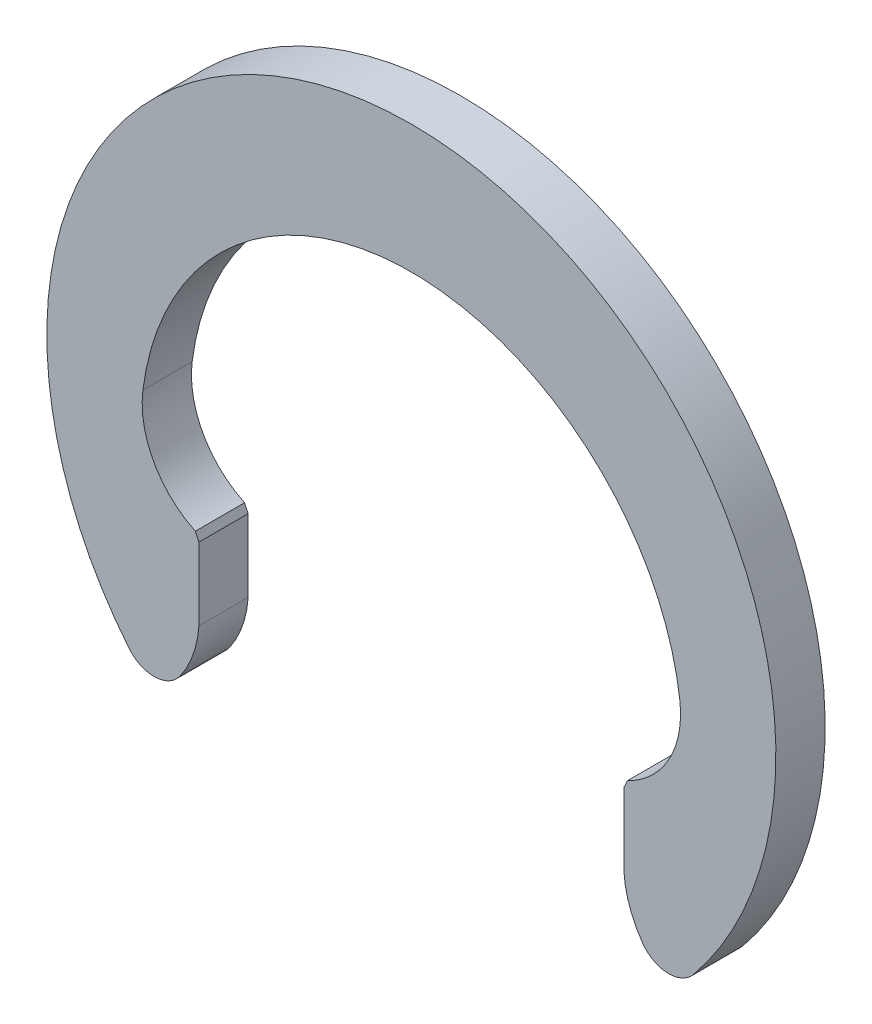
ISO-10303-21;
HEADER;
FILE_DESCRIPTION(('STEP AP214'),'2;1');
FILE_NAME('part.step','',(''),(''),'','','');
FILE_SCHEMA(('AUTOMOTIVE_DESIGN { 1 0 10303 214 1 1 1 1 }'));
ENDSEC;
DATA;
#1=APPLICATION_CONTEXT('core data for automotive mechanical design processes');
#2=APPLICATION_PROTOCOL_DEFINITION('international standard','automotive_design',2000,#1);
#3=PRODUCT_CONTEXT('',#1,'mechanical');
#4=PRODUCT('Part','Part','',(#3));
#5=PRODUCT_RELATED_PRODUCT_CATEGORY('part','',(#4));
#6=PRODUCT_DEFINITION_FORMATION('','',#4);
#7=PRODUCT_DEFINITION_CONTEXT('part definition',#1,'design');
#8=PRODUCT_DEFINITION('design','',#6,#7);
#9=PRODUCT_DEFINITION_SHAPE('','',#8);
#10=(LENGTH_UNIT() NAMED_UNIT(*) SI_UNIT(.MILLI.,.METRE.));
#11=(NAMED_UNIT(*) PLANE_ANGLE_UNIT() SI_UNIT($,.RADIAN.));
#12=(NAMED_UNIT(*) SI_UNIT($,.STERADIAN.) SOLID_ANGLE_UNIT());
#13=UNCERTAINTY_MEASURE_WITH_UNIT(LENGTH_MEASURE(1.E-05),#10,'distance_accuracy_value','');
#14=(GEOMETRIC_REPRESENTATION_CONTEXT(3) GLOBAL_UNCERTAINTY_ASSIGNED_CONTEXT((#13)) GLOBAL_UNIT_ASSIGNED_CONTEXT((#10,
#11,#12)) REPRESENTATION_CONTEXT('',''));
#15=CARTESIAN_POINT('',(0.,0.,0.));
#16=DIRECTION('',(0.,0.,1.));
#17=DIRECTION('',(1.,0.,0.));
#18=AXIS2_PLACEMENT_3D('',#15,#16,#17);
#19=CARTESIAN_POINT('',(0.,0.,-0.35));
#20=DIRECTION('',(0.,0.,1.));
#21=DIRECTION('',(1.,0.,0.));
#22=AXIS2_PLACEMENT_3D('',#19,#20,#21);
#23=PLANE('',#22);
#24=CARTESIAN_POINT('',(0.,0.,-0.35));
#25=DIRECTION('',(0.,0.,1.));
#26=DIRECTION('',(1.,0.,0.));
#27=AXIS2_PLACEMENT_3D('',#24,#25,#26);
#28=CIRCLE('',#27,3.7);
#29=CARTESIAN_POINT('',(2.86362795950369,-2.34299699307292,-0.35));
#30=VERTEX_POINT('',#29);
#31=CARTESIAN_POINT('',(-2.86362795950368,-2.34299699307293,-0.35));
#32=VERTEX_POINT('',#31);
#33=EDGE_CURVE('E189',#30,#32,#28,.T.);
#34=ORIENTED_EDGE('',*,*,#33,.F.);
#35=CARTESIAN_POINT('',(2.6120930711689,-2.13719320314084,-0.35));
#36=DIRECTION('',(0.,0.,-1.));
#37=DIRECTION('',(1.,0.,0.));
#38=AXIS2_PLACEMENT_3D('',#35,#36,#37);
#39=CIRCLE('',#38,0.325);
#40=CARTESIAN_POINT('',(2.34627823993633,-2.32418912688464,-0.35));
#41=VERTEX_POINT('',#40);
#42=EDGE_CURVE('E137',#30,#41,#39,.T.);
#43=ORIENTED_EDGE('',*,*,#42,.T.);
#44=CARTESIAN_POINT('',(3.20865351956933,-1.71752372269696,-0.35));
#45=DIRECTION('',(0.,0.,1.));
#46=DIRECTION('',(1.,0.,0.));
#47=AXIS2_PLACEMENT_3D('',#44,#45,#46);
#48=CIRCLE('',#47,1.05438799099777);
#49=CARTESIAN_POINT('',(2.15667568261897,-1.78877444989019,-0.35));
#50=VERTEX_POINT('',#49);
#51=EDGE_CURVE('E145',#50,#41,#48,.T.);
#52=ORIENTED_EDGE('',*,*,#51,.F.);
#53=DIRECTION('',(0.,-1.,0.));
#54=VECTOR('',#53,1.);
#55=CARTESIAN_POINT('',(2.15667568261898,-1.78877444989019,-0.35));
#56=LINE('',#55,#54);
#57=CARTESIAN_POINT('',(2.15667568261897,-1.05297198443263,-0.35));
#58=VERTEX_POINT('',#57);
#59=EDGE_CURVE('E11',#58,#50,#56,.T.);
#60=ORIENTED_EDGE('',*,*,#59,.F.);
#61=CARTESIAN_POINT('',(0.,0.,-0.35));
#62=DIRECTION('',(0.,0.,-1.));
#63=DIRECTION('',(-1.,0.,0.));
#64=AXIS2_PLACEMENT_3D('',#61,#62,#63);
#65=CIRCLE('',#64,2.4);
#66=CARTESIAN_POINT('',(2.19302872758202,-0.975,-0.35));
#67=VERTEX_POINT('',#66);
#68=EDGE_CURVE('E175',#67,#58,#65,.T.);
#69=ORIENTED_EDGE('',*,*,#68,.F.);
#70=CARTESIAN_POINT('',(1.78492705087858,-0.119710168645288,-0.35));
#71=DIRECTION('',(0.,0.,-1.));
#72=DIRECTION('',(-1.,0.,0.));
#73=AXIS2_PLACEMENT_3D('',#70,#71,#72);
#74=CIRCLE('',#73,0.947664325669659);
#75=CARTESIAN_POINT('',(2.725,0.,-0.35));
#76=VERTEX_POINT('',#75);
#77=EDGE_CURVE('E176',#76,#67,#74,.T.);
#78=ORIENTED_EDGE('',*,*,#77,.F.);
#79=CARTESIAN_POINT('',(0.,-0.347005208333333,-0.35));
#80=DIRECTION('',(0.,0.,-1.));
#81=DIRECTION('',(1.,0.,0.));
#82=AXIS2_PLACEMENT_3D('',#79,#80,#81);
#83=CIRCLE('',#82,2.74700520833333);
#84=CARTESIAN_POINT('',(-2.725,0.,-0.35));
#85=VERTEX_POINT('',#84);
#86=EDGE_CURVE('E225',#85,#76,#83,.T.);
#87=ORIENTED_EDGE('',*,*,#86,.F.);
#88=CARTESIAN_POINT('',(-1.78492705087858,-0.119710168645288,-0.35));
#89=DIRECTION('',(0.,0.,-1.));
#90=DIRECTION('',(1.,0.,0.));
#91=AXIS2_PLACEMENT_3D('',#88,#89,#90);
#92=CIRCLE('',#91,0.947664325669659);
#93=CARTESIAN_POINT('',(-2.19302872758202,-0.975,-0.35));
#94=VERTEX_POINT('',#93);
#95=EDGE_CURVE('E185',#94,#85,#92,.T.);
#96=ORIENTED_EDGE('',*,*,#95,.F.);
#97=CARTESIAN_POINT('',(0.,0.,-0.35));
#98=DIRECTION('',(0.,0.,-1.));
#99=DIRECTION('',(1.,0.,0.));
#100=AXIS2_PLACEMENT_3D('',#97,#98,#99);
#101=CIRCLE('',#100,2.4);
#102=CARTESIAN_POINT('',(-2.15667568261897,-1.05297198443263,-0.35));
#103=VERTEX_POINT('',#102);
#104=EDGE_CURVE('E90',#103,#94,#101,.T.);
#105=ORIENTED_EDGE('',*,*,#104,.F.);
#106=DIRECTION('',(0.,1.,0.));
#107=VECTOR('',#106,1.);
#108=CARTESIAN_POINT('',(-2.15667568261897,-1.42087321716141,-0.35));
#109=LINE('',#108,#107);
#110=CARTESIAN_POINT('',(-2.15667568261897,-1.78877444989019,-0.35));
#111=VERTEX_POINT('',#110);
#112=EDGE_CURVE('E170',#111,#103,#109,.T.);
#113=ORIENTED_EDGE('',*,*,#112,.F.);
#114=CARTESIAN_POINT('',(-3.20865351956933,-1.71752372269696,-0.35));
#115=DIRECTION('',(0.,0.,1.));
#116=DIRECTION('',(-1.,0.,0.));
#117=AXIS2_PLACEMENT_3D('',#114,#115,#116);
#118=CIRCLE('',#117,1.05438799099777);
#119=CARTESIAN_POINT('',(-2.34627823993633,-2.32418912688465,-0.35));
#120=VERTEX_POINT('',#119);
#121=EDGE_CURVE('E190',#120,#111,#118,.T.);
#122=ORIENTED_EDGE('',*,*,#121,.F.);
#123=CARTESIAN_POINT('',(-2.6120930711689,-2.13719320314084,-0.35));
#124=DIRECTION('',(0.,0.,-1.));
#125=DIRECTION('',(1.,0.,0.));
#126=AXIS2_PLACEMENT_3D('',#123,#124,#125);
#127=CIRCLE('',#126,0.325);
#128=EDGE_CURVE('E77',#120,#32,#127,.T.);
#129=ORIENTED_EDGE('',*,*,#128,.T.);
#130=EDGE_LOOP('',(#34,#43,#52,#60,#69,#78,#87,#96,#105,#113,#122,#129));
#131=FACE_BOUND('',#130,.T.);
#132=ADVANCED_FACE('F16',(#131),#23,.F.);
#133=CARTESIAN_POINT('',(2.15667568261898,-1.78877444989019,0.35));
#134=DIRECTION('',(1.,0.,0.));
#135=DIRECTION('',(0.,1.,0.));
#136=AXIS2_PLACEMENT_3D('',#133,#134,#135);
#137=PLANE('',#136);
#138=DIRECTION('',(0.,1.,0.));
#139=VECTOR('',#138,1.);
#140=CARTESIAN_POINT('',(2.15667568261897,-0.894387224945091,0.15));
#141=LINE('',#140,#139);
#142=CARTESIAN_POINT('',(2.15667568261897,-1.78877444989019,0.15));
#143=VERTEX_POINT('',#142);
#144=CARTESIAN_POINT('',(2.15667568261897,-1.05297198443263,0.15));
#145=VERTEX_POINT('',#144);
#146=EDGE_CURVE('E241',#143,#145,#141,.T.);
#147=ORIENTED_EDGE('',*,*,#146,.T.);
#148=DIRECTION('',(0.,0.,-1.));
#149=VECTOR('',#148,1.);
#150=CARTESIAN_POINT('',(2.15667568261897,-1.05297198443263,0.35));
#151=LINE('',#150,#149);
#152=EDGE_CURVE('E27',#145,#58,#151,.T.);
#153=ORIENTED_EDGE('',*,*,#152,.T.);
#154=ORIENTED_EDGE('',*,*,#59,.T.);
#155=DIRECTION('',(0.,0.,-1.));
#156=VECTOR('',#155,1.);
#157=CARTESIAN_POINT('',(2.15667568261897,-1.78877444989019,0.35));
#158=LINE('',#157,#156);
#159=EDGE_CURVE('E149',#143,#50,#158,.T.);
#160=ORIENTED_EDGE('',*,*,#159,.F.);
#161=EDGE_LOOP('',(#147,#153,#154,#160));
#162=FACE_BOUND('',#161,.T.);
#163=ADVANCED_FACE('F18',(#162),#137,.F.);
#164=CARTESIAN_POINT('',(0.,0.,0.35));
#165=DIRECTION('',(0.,0.,-1.));
#166=DIRECTION('',(-1.,0.,0.));
#167=AXIS2_PLACEMENT_3D('',#164,#165,#166);
#168=CYLINDRICAL_SURFACE('',#167,2.4);
#169=CARTESIAN_POINT('',(0.,0.,0.15));
#170=DIRECTION('',(0.,0.,1.));
#171=DIRECTION('',(-1.,0.,0.));
#172=AXIS2_PLACEMENT_3D('',#169,#170,#171);
#173=CIRCLE('',#172,2.4);
#174=CARTESIAN_POINT('',(2.19302872758202,-0.975,0.15));
#175=VERTEX_POINT('',#174);
#176=EDGE_CURVE('E249',#145,#175,#173,.T.);
#177=ORIENTED_EDGE('',*,*,#176,.T.);
#178=DIRECTION('',(0.,0.,-1.));
#179=VECTOR('',#178,1.);
#180=CARTESIAN_POINT('',(2.19302872758202,-0.975,0.35));
#181=LINE('',#180,#179);
#182=EDGE_CURVE('E171',#175,#67,#181,.T.);
#183=ORIENTED_EDGE('',*,*,#182,.T.);
#184=ORIENTED_EDGE('',*,*,#68,.T.);
#185=ORIENTED_EDGE('',*,*,#152,.F.);
#186=EDGE_LOOP('',(#177,#183,#184,#185));
#187=FACE_BOUND('',#186,.T.);
#188=ADVANCED_FACE('F279',(#187),#168,.F.);
#189=CARTESIAN_POINT('',(1.78492705087858,-0.119710168645288,0.35));
#190=DIRECTION('',(0.,0.,-1.));
#191=DIRECTION('',(0.87783762329979,-0.478958356351965,0.));
#192=AXIS2_PLACEMENT_3D('',#189,#190,#191);
#193=CYLINDRICAL_SURFACE('',#192,0.947664325669659);
#194=CARTESIAN_POINT('',(1.78492705087858,-0.119710168645288,0.15));
#195=DIRECTION('',(0.,0.,1.));
#196=DIRECTION('',(-1.,0.,0.));
#197=AXIS2_PLACEMENT_3D('',#194,#195,#196);
#198=CIRCLE('',#197,0.947664325669659);
#199=CARTESIAN_POINT('',(2.725,0.,0.15));
#200=VERTEX_POINT('',#199);
#201=EDGE_CURVE('E254',#175,#200,#198,.T.);
#202=ORIENTED_EDGE('',*,*,#201,.T.);
#203=DIRECTION('',(0.,0.,-1.));
#204=VECTOR('',#203,1.);
#205=CARTESIAN_POINT('',(2.725,0.,0.35));
#206=LINE('',#205,#204);
#207=EDGE_CURVE('E221',#200,#76,#206,.T.);
#208=ORIENTED_EDGE('',*,*,#207,.T.);
#209=ORIENTED_EDGE('',*,*,#77,.T.);
#210=ORIENTED_EDGE('',*,*,#182,.F.);
#211=EDGE_LOOP('',(#202,#208,#209,#210));
#212=FACE_BOUND('',#211,.T.);
#213=ADVANCED_FACE('F285',(#212),#193,.F.);
#214=CARTESIAN_POINT('',(0.,-0.347005208333333,0.35));
#215=DIRECTION('',(0.,0.,-1.));
#216=DIRECTION('',(-1.,0.,0.));
#217=AXIS2_PLACEMENT_3D('',#214,#215,#216);
#218=CYLINDRICAL_SURFACE('',#217,2.74700520833333);
#219=CARTESIAN_POINT('',(0.,-0.347005208333333,0.15));
#220=DIRECTION('',(0.,0.,1.));
#221=DIRECTION('',(-1.,0.,0.));
#222=AXIS2_PLACEMENT_3D('',#219,#220,#221);
#223=CIRCLE('',#222,2.74700520833333);
#224=CARTESIAN_POINT('',(-2.725,0.,0.15));
#225=VERTEX_POINT('',#224);
#226=EDGE_CURVE('E197',#200,#225,#223,.T.);
#227=ORIENTED_EDGE('',*,*,#226,.T.);
#228=DIRECTION('',(0.,0.,-1.));
#229=VECTOR('',#228,1.);
#230=CARTESIAN_POINT('',(-2.725,0.,0.35));
#231=LINE('',#230,#229);
#232=EDGE_CURVE('E181',#225,#85,#231,.T.);
#233=ORIENTED_EDGE('',*,*,#232,.T.);
#234=ORIENTED_EDGE('',*,*,#86,.T.);
#235=ORIENTED_EDGE('',*,*,#207,.F.);
#236=EDGE_LOOP('',(#227,#233,#234,#235));
#237=FACE_BOUND('',#236,.T.);
#238=ADVANCED_FACE('F288',(#237),#218,.F.);
#239=CARTESIAN_POINT('',(0.,0.,0.35));
#240=DIRECTION('',(0.,0.,-1.));
#241=DIRECTION('',(-1.,0.,0.));
#242=AXIS2_PLACEMENT_3D('',#239,#240,#241);
#243=CYLINDRICAL_SURFACE('',#242,2.4);
#244=CARTESIAN_POINT('',(0.,0.,0.15));
#245=DIRECTION('',(0.,0.,1.));
#246=DIRECTION('',(-1.,0.,0.));
#247=AXIS2_PLACEMENT_3D('',#244,#245,#246);
#248=CIRCLE('',#247,2.4);
#249=CARTESIAN_POINT('',(-2.19302872758202,-0.975,0.15));
#250=VERTEX_POINT('',#249);
#251=CARTESIAN_POINT('',(-2.15667568261897,-1.05297198443263,0.15));
#252=VERTEX_POINT('',#251);
#253=EDGE_CURVE('E198',#250,#252,#248,.T.);
#254=ORIENTED_EDGE('',*,*,#253,.T.);
#255=DIRECTION('',(0.,0.,-1.));
#256=VECTOR('',#255,1.);
#257=CARTESIAN_POINT('',(-2.15667568261897,-1.05297198443263,0.35));
#258=LINE('',#257,#256);
#259=EDGE_CURVE('E166',#252,#103,#258,.T.);
#260=ORIENTED_EDGE('',*,*,#259,.T.);
#261=ORIENTED_EDGE('',*,*,#104,.T.);
#262=DIRECTION('',(0.,0.,-1.));
#263=VECTOR('',#262,1.);
#264=CARTESIAN_POINT('',(-2.19302872758202,-0.975,0.35));
#265=LINE('',#264,#263);
#266=EDGE_CURVE('E153',#250,#94,#265,.T.);
#267=ORIENTED_EDGE('',*,*,#266,.F.);
#268=EDGE_LOOP('',(#254,#260,#261,#267));
#269=FACE_BOUND('',#268,.T.);
#270=ADVANCED_FACE('F293',(#269),#243,.F.);
#271=CARTESIAN_POINT('',(-1.78492705087858,-0.119710168645288,0.35));
#272=DIRECTION('',(0.,0.,-1.));
#273=DIRECTION('',(-1.,0.,0.));
#274=AXIS2_PLACEMENT_3D('',#271,#272,#273);
#275=CYLINDRICAL_SURFACE('',#274,0.947664325669659);
#276=CARTESIAN_POINT('',(-1.78492705087858,-0.119710168645288,0.15));
#277=DIRECTION('',(0.,0.,1.));
#278=DIRECTION('',(-1.,0.,0.));
#279=AXIS2_PLACEMENT_3D('',#276,#277,#278);
#280=CIRCLE('',#279,0.947664325669659);
#281=EDGE_CURVE('E193',#225,#250,#280,.T.);
#282=ORIENTED_EDGE('',*,*,#281,.T.);
#283=ORIENTED_EDGE('',*,*,#266,.T.);
#284=ORIENTED_EDGE('',*,*,#95,.T.);
#285=ORIENTED_EDGE('',*,*,#232,.F.);
#286=EDGE_LOOP('',(#282,#283,#284,#285));
#287=FACE_BOUND('',#286,.T.);
#288=ADVANCED_FACE('F290',(#287),#275,.F.);
#289=CARTESIAN_POINT('',(3.20865351956933,-1.71752372269696,0.35));
#290=DIRECTION('',(0.,0.,-1.));
#291=DIRECTION('',(-1.,0.,0.));
#292=AXIS2_PLACEMENT_3D('',#289,#290,#291);
#293=CYLINDRICAL_SURFACE('',#292,1.05438799099777);
#294=CARTESIAN_POINT('',(3.20865351956933,-1.71752372269696,0.15));
#295=DIRECTION('',(0.,0.,-1.));
#296=DIRECTION('',(-1.,0.,0.));
#297=AXIS2_PLACEMENT_3D('',#294,#295,#296);
#298=CIRCLE('',#297,1.05438799099777);
#299=CARTESIAN_POINT('',(2.34627823993633,-2.32418912688464,0.15));
#300=VERTEX_POINT('',#299);
#301=EDGE_CURVE('E20',#300,#143,#298,.T.);
#302=ORIENTED_EDGE('',*,*,#301,.T.);
#303=ORIENTED_EDGE('',*,*,#159,.T.);
#304=ORIENTED_EDGE('',*,*,#51,.T.);
#305=DIRECTION('',(0.,0.,1.));
#306=VECTOR('',#305,1.);
#307=CARTESIAN_POINT('',(2.34627823993633,-2.32418912688464,0.35));
#308=LINE('',#307,#306);
#309=EDGE_CURVE('E163',#41,#300,#308,.T.);
#310=ORIENTED_EDGE('',*,*,#309,.T.);
#311=EDGE_LOOP('',(#302,#303,#304,#310));
#312=FACE_BOUND('',#311,.T.);
#313=ADVANCED_FACE('F156',(#312),#293,.T.);
#314=CARTESIAN_POINT('',(2.6120930711689,-2.13719320314084,0.35));
#315=DIRECTION('',(0.,0.,-1.));
#316=DIRECTION('',(-1.,0.,0.));
#317=AXIS2_PLACEMENT_3D('',#314,#315,#316);
#318=CYLINDRICAL_SURFACE('',#317,0.325);
#319=CARTESIAN_POINT('',(2.6120930711689,-2.13719320314084,0.15));
#320=DIRECTION('',(0.,0.,-1.));
#321=DIRECTION('',(-1.,0.,0.));
#322=AXIS2_PLACEMENT_3D('',#319,#320,#321);
#323=CIRCLE('',#322,0.325);
#324=CARTESIAN_POINT('',(2.86362795950369,-2.34299699307292,0.15));
#325=VERTEX_POINT('',#324);
#326=EDGE_CURVE('E216',#325,#300,#323,.T.);
#327=ORIENTED_EDGE('',*,*,#326,.T.);
#328=ORIENTED_EDGE('',*,*,#309,.F.);
#329=ORIENTED_EDGE('',*,*,#42,.F.);
#330=DIRECTION('',(0.,0.,-1.));
#331=VECTOR('',#330,1.);
#332=CARTESIAN_POINT('',(2.86362795950369,-2.34299699307292,0.35));
#333=LINE('',#332,#331);
#334=EDGE_CURVE('E179',#325,#30,#333,.T.);
#335=ORIENTED_EDGE('',*,*,#334,.F.);
#336=EDGE_LOOP('',(#327,#328,#329,#335));
#337=FACE_BOUND('',#336,.T.);
#338=ADVANCED_FACE('F306',(#337),#318,.T.);
#339=CARTESIAN_POINT('',(0.,0.,0.35));
#340=DIRECTION('',(0.,0.,-1.));
#341=DIRECTION('',(0.,1.,0.));
#342=AXIS2_PLACEMENT_3D('',#339,#340,#341);
#343=CYLINDRICAL_SURFACE('',#342,3.7);
#344=CARTESIAN_POINT('',(0.,0.,0.15));
#345=DIRECTION('',(0.,0.,-1.));
#346=DIRECTION('',(-1.,0.,0.));
#347=AXIS2_PLACEMENT_3D('',#344,#345,#346);
#348=CIRCLE('',#347,3.7);
#349=CARTESIAN_POINT('',(-2.86362795950368,-2.34299699307293,0.15));
#350=VERTEX_POINT('',#349);
#351=EDGE_CURVE('E220',#350,#325,#348,.T.);
#352=ORIENTED_EDGE('',*,*,#351,.T.);
#353=ORIENTED_EDGE('',*,*,#334,.T.);
#354=ORIENTED_EDGE('',*,*,#33,.T.);
#355=DIRECTION('',(0.,0.,1.));
#356=VECTOR('',#355,1.);
#357=CARTESIAN_POINT('',(-2.86362795950368,-2.34299699307293,0.35));
#358=LINE('',#357,#356);
#359=EDGE_CURVE('E180',#32,#350,#358,.T.);
#360=ORIENTED_EDGE('',*,*,#359,.T.);
#361=EDGE_LOOP('',(#352,#353,#354,#360));
#362=FACE_BOUND('',#361,.T.);
#363=ADVANCED_FACE('F305',(#362),#343,.T.);
#364=CARTESIAN_POINT('',(-2.6120930711689,-2.13719320314084,0.35));
#365=DIRECTION('',(0.,0.,-1.));
#366=DIRECTION('',(-1.,0.,0.));
#367=AXIS2_PLACEMENT_3D('',#364,#365,#366);
#368=CYLINDRICAL_SURFACE('',#367,0.325);
#369=CARTESIAN_POINT('',(-2.6120930711689,-2.13719320314084,0.15));
#370=DIRECTION('',(0.,0.,-1.));
#371=DIRECTION('',(-1.,0.,0.));
#372=AXIS2_PLACEMENT_3D('',#369,#370,#371);
#373=CIRCLE('',#372,0.325);
#374=CARTESIAN_POINT('',(-2.34627823993633,-2.32418912688465,0.15));
#375=VERTEX_POINT('',#374);
#376=EDGE_CURVE('E208',#375,#350,#373,.T.);
#377=ORIENTED_EDGE('',*,*,#376,.T.);
#378=ORIENTED_EDGE('',*,*,#359,.F.);
#379=ORIENTED_EDGE('',*,*,#128,.F.);
#380=DIRECTION('',(0.,0.,-1.));
#381=VECTOR('',#380,1.);
#382=CARTESIAN_POINT('',(-2.34627823993633,-2.32418912688465,0.35));
#383=LINE('',#382,#381);
#384=EDGE_CURVE('E169',#375,#120,#383,.T.);
#385=ORIENTED_EDGE('',*,*,#384,.F.);
#386=EDGE_LOOP('',(#377,#378,#379,#385));
#387=FACE_BOUND('',#386,.T.);
#388=ADVANCED_FACE('F301',(#387),#368,.T.);
#389=CARTESIAN_POINT('',(-3.20865351956933,-1.71752372269696,0.35));
#390=DIRECTION('',(0.,0.,-1.));
#391=DIRECTION('',(-1.,0.,0.));
#392=AXIS2_PLACEMENT_3D('',#389,#390,#391);
#393=CYLINDRICAL_SURFACE('',#392,1.05438799099777);
#394=CARTESIAN_POINT('',(-3.20865351956933,-1.71752372269696,0.15));
#395=DIRECTION('',(0.,0.,-1.));
#396=DIRECTION('',(-1.,0.,0.));
#397=AXIS2_PLACEMENT_3D('',#394,#395,#396);
#398=CIRCLE('',#397,1.05438799099777);
#399=CARTESIAN_POINT('',(-2.15667568261897,-1.78877444989019,0.15));
#400=VERTEX_POINT('',#399);
#401=EDGE_CURVE('E203',#400,#375,#398,.T.);
#402=ORIENTED_EDGE('',*,*,#401,.T.);
#403=ORIENTED_EDGE('',*,*,#384,.T.);
#404=ORIENTED_EDGE('',*,*,#121,.T.);
#405=DIRECTION('',(0.,0.,-1.));
#406=VECTOR('',#405,1.);
#407=CARTESIAN_POINT('',(-2.15667568261897,-1.78877444989019,0.35));
#408=LINE('',#407,#406);
#409=EDGE_CURVE('E237',#400,#111,#408,.T.);
#410=ORIENTED_EDGE('',*,*,#409,.F.);
#411=EDGE_LOOP('',(#402,#403,#404,#410));
#412=FACE_BOUND('',#411,.T.);
#413=ADVANCED_FACE('F298',(#412),#393,.T.);
#414=CARTESIAN_POINT('',(-2.15667568261897,-1.42087321716141,0.35));
#415=DIRECTION('',(-1.,0.,0.));
#416=DIRECTION('',(0.,0.,1.));
#417=AXIS2_PLACEMENT_3D('',#414,#415,#416);
#418=PLANE('',#417);
#419=DIRECTION('',(0.,-1.,0.));
#420=VECTOR('',#419,1.);
#421=CARTESIAN_POINT('',(-2.15667568261897,-0.710436608580704,0.15));
#422=LINE('',#421,#420);
#423=EDGE_CURVE('E207',#252,#400,#422,.T.);
#424=ORIENTED_EDGE('',*,*,#423,.T.);
#425=ORIENTED_EDGE('',*,*,#409,.T.);
#426=ORIENTED_EDGE('',*,*,#112,.T.);
#427=ORIENTED_EDGE('',*,*,#259,.F.);
#428=EDGE_LOOP('',(#424,#425,#426,#427));
#429=FACE_BOUND('',#428,.T.);
#430=ADVANCED_FACE('F296',(#429),#418,.F.);
#431=CARTESIAN_POINT('',(0.,0.,0.15));
#432=DIRECTION('',(0.,0.,1.));
#433=DIRECTION('',(1.,0.,0.));
#434=AXIS2_PLACEMENT_3D('',#431,#432,#433);
#435=PLANE('',#434);
#436=ORIENTED_EDGE('',*,*,#301,.F.);
#437=ORIENTED_EDGE('',*,*,#326,.F.);
#438=ORIENTED_EDGE('',*,*,#351,.F.);
#439=ORIENTED_EDGE('',*,*,#376,.F.);
#440=ORIENTED_EDGE('',*,*,#401,.F.);
#441=ORIENTED_EDGE('',*,*,#423,.F.);
#442=ORIENTED_EDGE('',*,*,#253,.F.);
#443=ORIENTED_EDGE('',*,*,#281,.F.);
#444=ORIENTED_EDGE('',*,*,#226,.F.);
#445=ORIENTED_EDGE('',*,*,#201,.F.);
#446=ORIENTED_EDGE('',*,*,#176,.F.);
#447=ORIENTED_EDGE('',*,*,#146,.F.);
#448=EDGE_LOOP('',(#436,#437,#438,#439,#440,#441,#442,#443,#444,#445,#446,#447));
#449=FACE_BOUND('',#448,.T.);
#450=ADVANCED_FACE('F282',(#449),#435,.T.);
#451=CLOSED_SHELL('',(#132,#163,#188,#213,#238,#270,#288,#313,#338,#363,#388,#413,#430,#450));
#452=MANIFOLD_SOLID_BREP('B1',#451);
#453=ADVANCED_BREP_SHAPE_REPRESENTATION('',(#18,#452),#14);
#454=SHAPE_DEFINITION_REPRESENTATION(#9,#453);
ENDSEC;
END-ISO-10303-21;
